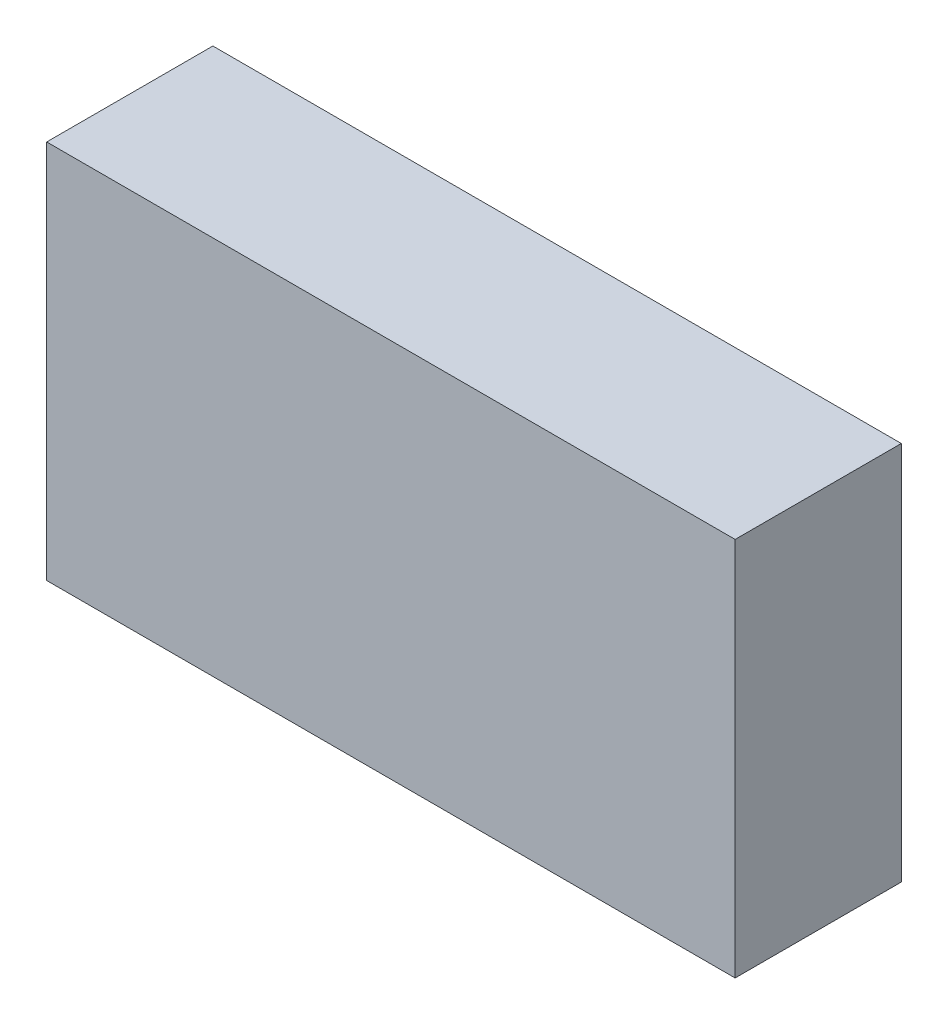
ISO-10303-21;
HEADER;
FILE_DESCRIPTION(('STEP AP214'),'2;1');
FILE_NAME('part.step','',(''),(''),'','','');
FILE_SCHEMA(('AUTOMOTIVE_DESIGN { 1 0 10303 214 1 1 1 1 }'));
ENDSEC;
DATA;
#1=APPLICATION_CONTEXT('core data for automotive mechanical design processes');
#2=APPLICATION_PROTOCOL_DEFINITION('international standard','automotive_design',2000,#1);
#3=PRODUCT_CONTEXT('',#1,'mechanical');
#4=PRODUCT('Part','Part','',(#3));
#5=PRODUCT_RELATED_PRODUCT_CATEGORY('part','',(#4));
#6=PRODUCT_DEFINITION_FORMATION('','',#4);
#7=PRODUCT_DEFINITION_CONTEXT('part definition',#1,'design');
#8=PRODUCT_DEFINITION('design','',#6,#7);
#9=PRODUCT_DEFINITION_SHAPE('','',#8);
#10=(LENGTH_UNIT() NAMED_UNIT(*) SI_UNIT(.MILLI.,.METRE.));
#11=(NAMED_UNIT(*) PLANE_ANGLE_UNIT() SI_UNIT($,.RADIAN.));
#12=(NAMED_UNIT(*) SI_UNIT($,.STERADIAN.) SOLID_ANGLE_UNIT());
#13=UNCERTAINTY_MEASURE_WITH_UNIT(LENGTH_MEASURE(1.E-05),#10,'distance_accuracy_value','');
#14=(GEOMETRIC_REPRESENTATION_CONTEXT(3) GLOBAL_UNCERTAINTY_ASSIGNED_CONTEXT((#13)) GLOBAL_UNIT_ASSIGNED_CONTEXT((#10,
#11,#12)) REPRESENTATION_CONTEXT('',''));
#15=CARTESIAN_POINT('',(0.,0.,0.));
#16=DIRECTION('',(0.,0.,1.));
#17=DIRECTION('',(1.,0.,0.));
#18=AXIS2_PLACEMENT_3D('',#15,#16,#17);
#19=CARTESIAN_POINT('',(29.,16.0000000000001,14.));
#20=DIRECTION('',(-1.,0.,0.));
#21=DIRECTION('',(0.,-1.,0.));
#22=AXIS2_PLACEMENT_3D('',#19,#20,#21);
#23=PLANE('',#22);
#24=DIRECTION('',(0.,1.,0.));
#25=VECTOR('',#24,1.);
#26=CARTESIAN_POINT('',(29.,16.0000000000001,0.));
#27=LINE('',#26,#25);
#28=CARTESIAN_POINT('',(29.,-16.,0.));
#29=VERTEX_POINT('',#28);
#30=CARTESIAN_POINT('',(29.,16.0000000000001,0.));
#31=VERTEX_POINT('',#30);
#32=EDGE_CURVE('E107',#29,#31,#27,.T.);
#33=ORIENTED_EDGE('',*,*,#32,.T.);
#34=DIRECTION('',(0.,0.,-1.));
#35=VECTOR('',#34,1.);
#36=CARTESIAN_POINT('',(29.,16.0000000000001,14.));
#37=LINE('',#36,#35);
#38=CARTESIAN_POINT('',(29.,16.0000000000001,14.));
#39=VERTEX_POINT('',#38);
#40=EDGE_CURVE('E11',#39,#31,#37,.T.);
#41=ORIENTED_EDGE('',*,*,#40,.F.);
#42=DIRECTION('',(0.,1.,0.));
#43=VECTOR('',#42,1.);
#44=CARTESIAN_POINT('',(29.,16.0000000000001,14.));
#45=LINE('',#44,#43);
#46=CARTESIAN_POINT('',(29.,-16.,14.));
#47=VERTEX_POINT('',#46);
#48=EDGE_CURVE('E91',#47,#39,#45,.T.);
#49=ORIENTED_EDGE('',*,*,#48,.F.);
#50=DIRECTION('',(0.,0.,-1.));
#51=VECTOR('',#50,1.);
#52=CARTESIAN_POINT('',(29.,-16.,14.));
#53=LINE('',#52,#51);
#54=EDGE_CURVE('E103',#47,#29,#53,.T.);
#55=ORIENTED_EDGE('',*,*,#54,.T.);
#56=EDGE_LOOP('',(#33,#41,#49,#55));
#57=FACE_BOUND('',#56,.T.);
#58=ADVANCED_FACE('F39',(#57),#23,.F.);
#59=CARTESIAN_POINT('',(-29.,16.0000000000001,14.));
#60=DIRECTION('',(0.,-1.,0.));
#61=DIRECTION('',(0.,0.,-1.));
#62=AXIS2_PLACEMENT_3D('',#59,#60,#61);
#63=PLANE('',#62);
#64=DIRECTION('',(-1.,0.,0.));
#65=VECTOR('',#64,1.);
#66=CARTESIAN_POINT('',(-29.,16.0000000000001,0.));
#67=LINE('',#66,#65);
#68=CARTESIAN_POINT('',(-29.,16.0000000000001,0.));
#69=VERTEX_POINT('',#68);
#70=EDGE_CURVE('E96',#31,#69,#67,.T.);
#71=ORIENTED_EDGE('',*,*,#70,.T.);
#72=DIRECTION('',(0.,0.,-1.));
#73=VECTOR('',#72,1.);
#74=CARTESIAN_POINT('',(-29.,16.0000000000001,14.));
#75=LINE('',#74,#73);
#76=CARTESIAN_POINT('',(-29.,16.0000000000001,14.));
#77=VERTEX_POINT('',#76);
#78=EDGE_CURVE('E48',#77,#69,#75,.T.);
#79=ORIENTED_EDGE('',*,*,#78,.F.);
#80=DIRECTION('',(-1.,0.,0.));
#81=VECTOR('',#80,1.);
#82=CARTESIAN_POINT('',(-29.,16.0000000000001,14.));
#83=LINE('',#82,#81);
#84=EDGE_CURVE('E86',#39,#77,#83,.T.);
#85=ORIENTED_EDGE('',*,*,#84,.F.);
#86=ORIENTED_EDGE('',*,*,#40,.T.);
#87=EDGE_LOOP('',(#71,#79,#85,#86));
#88=FACE_BOUND('',#87,.T.);
#89=ADVANCED_FACE('F95',(#88),#63,.F.);
#90=CARTESIAN_POINT('',(-29.,16.0000000000001,14.));
#91=DIRECTION('',(1.,0.,0.));
#92=DIRECTION('',(0.,1.,0.));
#93=AXIS2_PLACEMENT_3D('',#90,#91,#92);
#94=PLANE('',#93);
#95=DIRECTION('',(0.,-1.,0.));
#96=VECTOR('',#95,1.);
#97=CARTESIAN_POINT('',(-29.,16.0000000000001,0.));
#98=LINE('',#97,#96);
#99=CARTESIAN_POINT('',(-29.,-16.,0.));
#100=VERTEX_POINT('',#99);
#101=EDGE_CURVE('E73',#69,#100,#98,.T.);
#102=ORIENTED_EDGE('',*,*,#101,.T.);
#103=DIRECTION('',(0.,0.,-1.));
#104=VECTOR('',#103,1.);
#105=CARTESIAN_POINT('',(-29.,-16.,14.));
#106=LINE('',#105,#104);
#107=CARTESIAN_POINT('',(-29.,-16.,14.));
#108=VERTEX_POINT('',#107);
#109=EDGE_CURVE('E98',#108,#100,#106,.T.);
#110=ORIENTED_EDGE('',*,*,#109,.F.);
#111=DIRECTION('',(0.,-1.,0.));
#112=VECTOR('',#111,1.);
#113=CARTESIAN_POINT('',(-29.,16.0000000000001,14.));
#114=LINE('',#113,#112);
#115=EDGE_CURVE('E89',#77,#108,#114,.T.);
#116=ORIENTED_EDGE('',*,*,#115,.F.);
#117=ORIENTED_EDGE('',*,*,#78,.T.);
#118=EDGE_LOOP('',(#102,#110,#116,#117));
#119=FACE_BOUND('',#118,.T.);
#120=ADVANCED_FACE('F99',(#119),#94,.F.);
#121=CARTESIAN_POINT('',(-29.,-16.,14.));
#122=DIRECTION('',(0.,1.,0.));
#123=DIRECTION('',(0.,0.,1.));
#124=AXIS2_PLACEMENT_3D('',#121,#122,#123);
#125=PLANE('',#124);
#126=DIRECTION('',(1.,0.,0.));
#127=VECTOR('',#126,1.);
#128=CARTESIAN_POINT('',(-29.,-16.,0.));
#129=LINE('',#128,#127);
#130=EDGE_CURVE('E79',#100,#29,#129,.T.);
#131=ORIENTED_EDGE('',*,*,#130,.T.);
#132=ORIENTED_EDGE('',*,*,#54,.F.);
#133=DIRECTION('',(1.,0.,0.));
#134=VECTOR('',#133,1.);
#135=CARTESIAN_POINT('',(-29.,-16.,14.));
#136=LINE('',#135,#134);
#137=EDGE_CURVE('E56',#108,#47,#136,.T.);
#138=ORIENTED_EDGE('',*,*,#137,.F.);
#139=ORIENTED_EDGE('',*,*,#109,.T.);
#140=EDGE_LOOP('',(#131,#132,#138,#139));
#141=FACE_BOUND('',#140,.T.);
#142=ADVANCED_FACE('F120',(#141),#125,.F.);
#143=CARTESIAN_POINT('',(0.,0.,14.));
#144=DIRECTION('',(0.,0.,1.));
#145=DIRECTION('',(1.,0.,0.));
#146=AXIS2_PLACEMENT_3D('',#143,#144,#145);
#147=PLANE('',#146);
#148=ORIENTED_EDGE('',*,*,#48,.T.);
#149=ORIENTED_EDGE('',*,*,#84,.T.);
#150=ORIENTED_EDGE('',*,*,#115,.T.);
#151=ORIENTED_EDGE('',*,*,#137,.T.);
#152=EDGE_LOOP('',(#148,#149,#150,#151));
#153=FACE_BOUND('',#152,.T.);
#154=ADVANCED_FACE('F87',(#153),#147,.T.);
#155=CARTESIAN_POINT('',(0.,0.,0.));
#156=DIRECTION('',(0.,0.,1.));
#157=DIRECTION('',(1.,0.,0.));
#158=AXIS2_PLACEMENT_3D('',#155,#156,#157);
#159=PLANE('',#158);
#160=ORIENTED_EDGE('',*,*,#32,.F.);
#161=ORIENTED_EDGE('',*,*,#130,.F.);
#162=ORIENTED_EDGE('',*,*,#101,.F.);
#163=ORIENTED_EDGE('',*,*,#70,.F.);
#164=EDGE_LOOP('',(#160,#161,#162,#163));
#165=FACE_BOUND('',#164,.T.);
#166=ADVANCED_FACE('F123',(#165),#159,.F.);
#167=CLOSED_SHELL('',(#58,#89,#120,#142,#154,#166));
#168=MANIFOLD_SOLID_BREP('B2',#167);
#169=ADVANCED_BREP_SHAPE_REPRESENTATION('',(#18,#168),#14);
#170=SHAPE_DEFINITION_REPRESENTATION(#9,#169);
ENDSEC;
END-ISO-10303-21;
